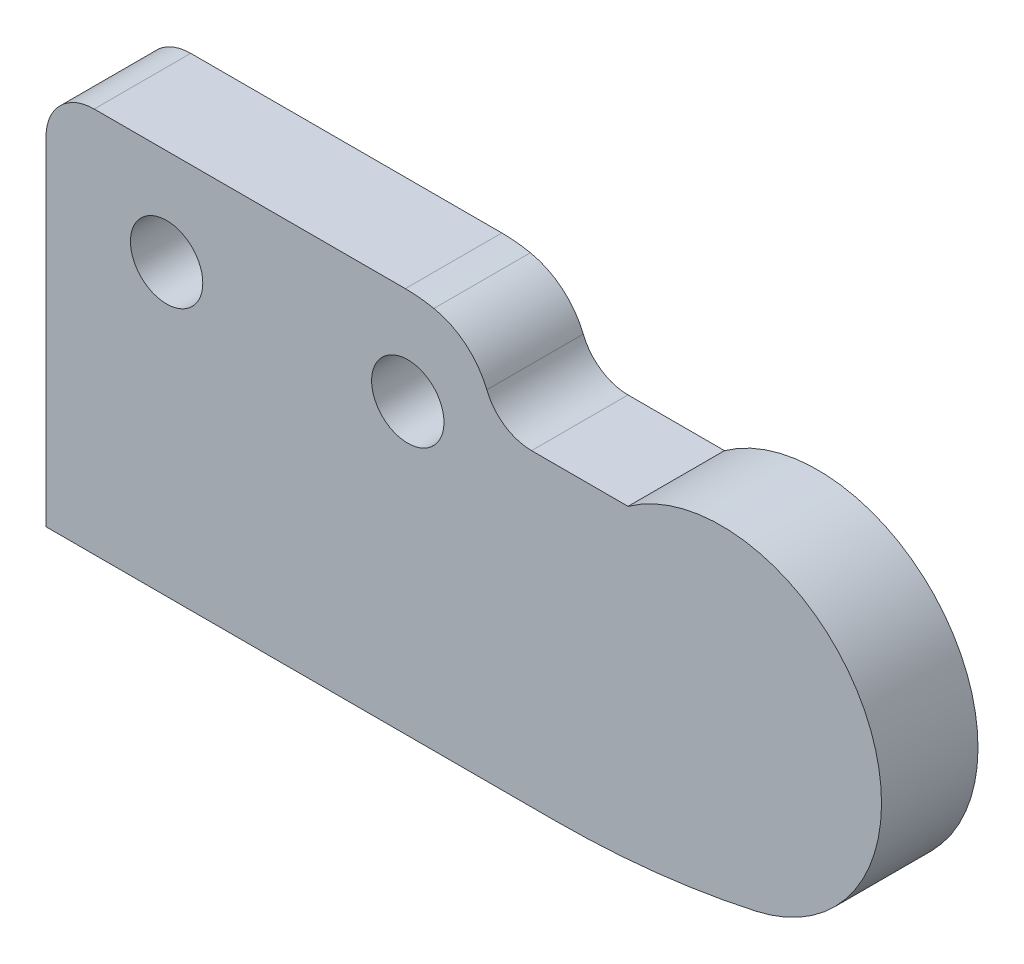
ISO-10303-21;
HEADER;
FILE_DESCRIPTION(('STEP AP214'),'2;1');
FILE_NAME('part.step','',(''),(''),'','','');
FILE_SCHEMA(('AUTOMOTIVE_DESIGN { 1 0 10303 214 1 1 1 1 }'));
ENDSEC;
DATA;
#1=APPLICATION_CONTEXT('core data for automotive mechanical design processes');
#2=APPLICATION_PROTOCOL_DEFINITION('international standard','automotive_design',2000,#1);
#3=PRODUCT_CONTEXT('',#1,'mechanical');
#4=PRODUCT('Part','Part','',(#3));
#5=PRODUCT_RELATED_PRODUCT_CATEGORY('part','',(#4));
#6=PRODUCT_DEFINITION_FORMATION('','',#4);
#7=PRODUCT_DEFINITION_CONTEXT('part definition',#1,'design');
#8=PRODUCT_DEFINITION('design','',#6,#7);
#9=PRODUCT_DEFINITION_SHAPE('','',#8);
#10=(LENGTH_UNIT() NAMED_UNIT(*) SI_UNIT(.MILLI.,.METRE.));
#11=(NAMED_UNIT(*) PLANE_ANGLE_UNIT() SI_UNIT($,.RADIAN.));
#12=(NAMED_UNIT(*) SI_UNIT($,.STERADIAN.) SOLID_ANGLE_UNIT());
#13=UNCERTAINTY_MEASURE_WITH_UNIT(LENGTH_MEASURE(1.E-05),#10,'distance_accuracy_value','');
#14=(GEOMETRIC_REPRESENTATION_CONTEXT(3) GLOBAL_UNCERTAINTY_ASSIGNED_CONTEXT((#13)) GLOBAL_UNIT_ASSIGNED_CONTEXT((#10,
#11,#12)) REPRESENTATION_CONTEXT('',''));
#15=CARTESIAN_POINT('',(0.,0.,0.));
#16=DIRECTION('',(0.,0.,1.));
#17=DIRECTION('',(1.,0.,0.));
#18=AXIS2_PLACEMENT_3D('',#15,#16,#17);
#19=CARTESIAN_POINT('',(-1.5,1.,2.));
#20=DIRECTION('',(0.,0.,1.));
#21=DIRECTION('',(1.,0.,0.));
#22=AXIS2_PLACEMENT_3D('',#19,#20,#21);
#23=PLANE('',#22);
#24=CARTESIAN_POINT('',(0.,0.,2.));
#25=DIRECTION('',(0.,0.,1.));
#26=DIRECTION('',(1.,0.,0.));
#27=AXIS2_PLACEMENT_3D('',#24,#25,#26);
#28=CIRCLE('',#27,0.75);
#29=CARTESIAN_POINT('',(0.75,0.,2.));
#30=VERTEX_POINT('',#29);
#31=EDGE_CURVE('E147',#30,#30,#28,.T.);
#32=ORIENTED_EDGE('',*,*,#31,.F.);
#33=EDGE_LOOP('',(#32));
#34=FACE_BOUND('',#33,.T.);
#35=CARTESIAN_POINT('',(-1.5,1.,2.));
#36=DIRECTION('',(0.,0.,1.));
#37=DIRECTION('',(1.,0.,0.));
#38=AXIS2_PLACEMENT_3D('',#35,#36,#37);
#39=CIRCLE('',#38,1.);
#40=CARTESIAN_POINT('',(-1.5,2.,2.));
#41=VERTEX_POINT('',#40);
#42=CARTESIAN_POINT('',(-2.5,0.999999999999999,2.));
#43=VERTEX_POINT('',#42);
#44=EDGE_CURVE('E162',#41,#43,#39,.T.);
#45=ORIENTED_EDGE('',*,*,#44,.T.);
#46=DIRECTION('',(0.,-1.,0.));
#47=VECTOR('',#46,1.);
#48=CARTESIAN_POINT('',(-2.5,0.999999999999999,2.));
#49=LINE('',#48,#47);
#50=CARTESIAN_POINT('',(-2.5,-6.,2.));
#51=VERTEX_POINT('',#50);
#52=EDGE_CURVE('E100',#43,#51,#49,.T.);
#53=ORIENTED_EDGE('',*,*,#52,.T.);
#54=DIRECTION('',(1.,0.,0.));
#55=VECTOR('',#54,1.);
#56=CARTESIAN_POINT('',(-2.5,-6.,2.));
#57=LINE('',#56,#55);
#58=CARTESIAN_POINT('',(8.03164583027408,-6.,2.));
#59=VERTEX_POINT('',#58);
#60=EDGE_CURVE('E183',#51,#59,#57,.T.);
#61=ORIENTED_EDGE('',*,*,#60,.T.);
#62=CARTESIAN_POINT('',(8.03164583027408,13.3857690870871,2.));
#63=DIRECTION('',(0.,0.,1.));
#64=DIRECTION('',(-1.,0.,0.));
#65=AXIS2_PLACEMENT_3D('',#62,#63,#64);
#66=CIRCLE('',#65,19.3857690870871);
#67=CARTESIAN_POINT('',(12.2170300254932,-5.5427966862691,2.));
#68=VERTEX_POINT('',#67);
#69=EDGE_CURVE('E202',#59,#68,#66,.T.);
#70=ORIENTED_EDGE('',*,*,#69,.T.);
#71=CARTESIAN_POINT('',(11.5,-2.3,2.));
#72=DIRECTION('',(0.,0.,1.));
#73=DIRECTION('',(-1.,0.,0.));
#74=AXIS2_PLACEMENT_3D('',#71,#72,#73);
#75=CIRCLE('',#74,3.3211236661613);
#76=CARTESIAN_POINT('',(9.56612761384402,0.400000000000001,2.));
#77=VERTEX_POINT('',#76);
#78=EDGE_CURVE('E199',#68,#77,#75,.T.);
#79=ORIENTED_EDGE('',*,*,#78,.T.);
#80=DIRECTION('',(-1.,0.,0.));
#81=VECTOR('',#80,1.);
#82=CARTESIAN_POINT('',(9.56612761384402,0.4,2.));
#83=LINE('',#82,#81);
#84=CARTESIAN_POINT('',(7.56612761384402,0.4,2.));
#85=VERTEX_POINT('',#84);
#86=EDGE_CURVE('E201',#77,#85,#83,.T.);
#87=ORIENTED_EDGE('',*,*,#86,.T.);
#88=CARTESIAN_POINT('',(7.56612761384402,1.4,2.));
#89=DIRECTION('',(0.,0.,-1.));
#90=DIRECTION('',(1.,0.,0.));
#91=AXIS2_PLACEMENT_3D('',#88,#89,#90);
#92=CIRCLE('',#91,1.);
#93=CARTESIAN_POINT('',(6.63783296713904,1.02815453626691,2.));
#94=VERTEX_POINT('',#93);
#95=EDGE_CURVE('E125',#85,#94,#92,.T.);
#96=ORIENTED_EDGE('',*,*,#95,.T.);
#97=CARTESIAN_POINT('',(5.24539099708157,0.470386340667267,2.));
#98=DIRECTION('',(0.,0.,1.));
#99=DIRECTION('',(-1.,0.,0.));
#100=AXIS2_PLACEMENT_3D('',#97,#98,#99);
#101=CIRCLE('',#100,1.5);
#102=CARTESIAN_POINT('',(5.54197826784538,1.94077268133453,2.));
#103=VERTEX_POINT('',#102);
#104=EDGE_CURVE('E119',#94,#103,#101,.T.);
#105=ORIENTED_EDGE('',*,*,#104,.T.);
#106=CARTESIAN_POINT('',(4.94880372631776,-1.,2.));
#107=DIRECTION('',(0.,0.,1.));
#108=DIRECTION('',(-1.,0.,0.));
#109=AXIS2_PLACEMENT_3D('',#106,#107,#108);
#110=CIRCLE('',#109,3.);
#111=CARTESIAN_POINT('',(4.94880372631776,2.,2.));
#112=VERTEX_POINT('',#111);
#113=EDGE_CURVE('E123',#103,#112,#110,.T.);
#114=ORIENTED_EDGE('',*,*,#113,.T.);
#115=DIRECTION('',(-1.,0.,0.));
#116=VECTOR('',#115,1.);
#117=CARTESIAN_POINT('',(4.94880372631776,2.,2.));
#118=LINE('',#117,#116);
#119=EDGE_CURVE('E51',#112,#41,#118,.T.);
#120=ORIENTED_EDGE('',*,*,#119,.T.);
#121=EDGE_LOOP('',(#45,#53,#61,#70,#79,#87,#96,#105,#114,#120));
#122=FACE_BOUND('',#121,.T.);
#123=CARTESIAN_POINT('',(5.,0.,2.));
#124=DIRECTION('',(0.,0.,1.));
#125=DIRECTION('',(1.,0.,0.));
#126=AXIS2_PLACEMENT_3D('',#123,#124,#125);
#127=CIRCLE('',#126,0.750000000000001);
#128=CARTESIAN_POINT('',(5.75,0.,2.));
#129=VERTEX_POINT('',#128);
#130=EDGE_CURVE('E213',#129,#129,#127,.T.);
#131=ORIENTED_EDGE('',*,*,#130,.F.);
#132=EDGE_LOOP('',(#131));
#133=FACE_BOUND('',#132,.T.);
#134=ADVANCED_FACE('F34',(#34,#122,#133),#23,.T.);
#135=CARTESIAN_POINT('',(-1.5,1.,0.));
#136=DIRECTION('',(0.,0.,1.));
#137=DIRECTION('',(1.,0.,0.));
#138=AXIS2_PLACEMENT_3D('',#135,#136,#137);
#139=PLANE('',#138);
#140=CARTESIAN_POINT('',(-1.5,1.,0.));
#141=DIRECTION('',(0.,0.,1.));
#142=DIRECTION('',(1.,0.,0.));
#143=AXIS2_PLACEMENT_3D('',#140,#141,#142);
#144=CIRCLE('',#143,1.);
#145=CARTESIAN_POINT('',(-1.5,2.,0.));
#146=VERTEX_POINT('',#145);
#147=CARTESIAN_POINT('',(-2.5,0.999999999999999,0.));
#148=VERTEX_POINT('',#147);
#149=EDGE_CURVE('E143',#146,#148,#144,.T.);
#150=ORIENTED_EDGE('',*,*,#149,.F.);
#151=DIRECTION('',(-1.,0.,0.));
#152=VECTOR('',#151,1.);
#153=CARTESIAN_POINT('',(4.94880372631776,2.,0.));
#154=LINE('',#153,#152);
#155=CARTESIAN_POINT('',(4.94880372631776,2.,0.));
#156=VERTEX_POINT('',#155);
#157=EDGE_CURVE('E92',#156,#146,#154,.T.);
#158=ORIENTED_EDGE('',*,*,#157,.F.);
#159=CARTESIAN_POINT('',(4.94880372631776,-1.,0.));
#160=DIRECTION('',(0.,0.,1.));
#161=DIRECTION('',(-1.,0.,0.));
#162=AXIS2_PLACEMENT_3D('',#159,#160,#161);
#163=CIRCLE('',#162,3.);
#164=CARTESIAN_POINT('',(5.54197826784538,1.94077268133453,0.));
#165=VERTEX_POINT('',#164);
#166=EDGE_CURVE('E86',#165,#156,#163,.T.);
#167=ORIENTED_EDGE('',*,*,#166,.F.);
#168=CARTESIAN_POINT('',(5.24539099708157,0.470386340667267,0.));
#169=DIRECTION('',(0.,0.,1.));
#170=DIRECTION('',(-1.,0.,0.));
#171=AXIS2_PLACEMENT_3D('',#168,#169,#170);
#172=CIRCLE('',#171,1.5);
#173=CARTESIAN_POINT('',(6.63783296713904,1.02815453626691,0.));
#174=VERTEX_POINT('',#173);
#175=EDGE_CURVE('E133',#174,#165,#172,.T.);
#176=ORIENTED_EDGE('',*,*,#175,.F.);
#177=CARTESIAN_POINT('',(7.56612761384402,1.4,0.));
#178=DIRECTION('',(0.,0.,-1.));
#179=DIRECTION('',(1.,0.,0.));
#180=AXIS2_PLACEMENT_3D('',#177,#178,#179);
#181=CIRCLE('',#180,1.);
#182=CARTESIAN_POINT('',(7.56612761384402,0.4,0.));
#183=VERTEX_POINT('',#182);
#184=EDGE_CURVE('E157',#183,#174,#181,.T.);
#185=ORIENTED_EDGE('',*,*,#184,.F.);
#186=DIRECTION('',(-1.,0.,0.));
#187=VECTOR('',#186,1.);
#188=CARTESIAN_POINT('',(9.56612761384402,0.4,0.));
#189=LINE('',#188,#187);
#190=CARTESIAN_POINT('',(9.56612761384402,0.400000000000001,0.));
#191=VERTEX_POINT('',#190);
#192=EDGE_CURVE('E155',#191,#183,#189,.T.);
#193=ORIENTED_EDGE('',*,*,#192,.F.);
#194=CARTESIAN_POINT('',(11.5,-2.3,0.));
#195=DIRECTION('',(0.,0.,1.));
#196=DIRECTION('',(-1.,0.,0.));
#197=AXIS2_PLACEMENT_3D('',#194,#195,#196);
#198=CIRCLE('',#197,3.3211236661613);
#199=CARTESIAN_POINT('',(12.2170300254932,-5.5427966862691,0.));
#200=VERTEX_POINT('',#199);
#201=EDGE_CURVE('E153',#200,#191,#198,.T.);
#202=ORIENTED_EDGE('',*,*,#201,.F.);
#203=CARTESIAN_POINT('',(8.03164583027408,13.3857690870871,0.));
#204=DIRECTION('',(0.,0.,1.));
#205=DIRECTION('',(-1.,0.,0.));
#206=AXIS2_PLACEMENT_3D('',#203,#204,#205);
#207=CIRCLE('',#206,19.3857690870871);
#208=CARTESIAN_POINT('',(8.03164583027408,-6.,0.));
#209=VERTEX_POINT('',#208);
#210=EDGE_CURVE('E151',#209,#200,#207,.T.);
#211=ORIENTED_EDGE('',*,*,#210,.F.);
#212=DIRECTION('',(1.,0.,0.));
#213=VECTOR('',#212,1.);
#214=CARTESIAN_POINT('',(-2.5,-6.,0.));
#215=LINE('',#214,#213);
#216=CARTESIAN_POINT('',(-2.5,-6.,0.));
#217=VERTEX_POINT('',#216);
#218=EDGE_CURVE('E149',#217,#209,#215,.T.);
#219=ORIENTED_EDGE('',*,*,#218,.F.);
#220=DIRECTION('',(0.,-1.,0.));
#221=VECTOR('',#220,1.);
#222=CARTESIAN_POINT('',(-2.5,0.999999999999999,0.));
#223=LINE('',#222,#221);
#224=EDGE_CURVE('E146',#148,#217,#223,.T.);
#225=ORIENTED_EDGE('',*,*,#224,.F.);
#226=EDGE_LOOP('',(#150,#158,#167,#176,#185,#193,#202,#211,#219,#225));
#227=FACE_BOUND('',#226,.T.);
#228=CARTESIAN_POINT('',(0.,0.,0.));
#229=DIRECTION('',(0.,0.,1.));
#230=DIRECTION('',(1.,0.,0.));
#231=AXIS2_PLACEMENT_3D('',#228,#229,#230);
#232=CIRCLE('',#231,0.75);
#233=CARTESIAN_POINT('',(0.75,0.,0.));
#234=VERTEX_POINT('',#233);
#235=EDGE_CURVE('E210',#234,#234,#232,.T.);
#236=ORIENTED_EDGE('',*,*,#235,.T.);
#237=EDGE_LOOP('',(#236));
#238=FACE_BOUND('',#237,.T.);
#239=CARTESIAN_POINT('',(5.,0.,0.));
#240=DIRECTION('',(0.,0.,1.));
#241=DIRECTION('',(1.,0.,0.));
#242=AXIS2_PLACEMENT_3D('',#239,#240,#241);
#243=CIRCLE('',#242,0.750000000000001);
#244=CARTESIAN_POINT('',(5.75,0.,0.));
#245=VERTEX_POINT('',#244);
#246=EDGE_CURVE('E216',#245,#245,#243,.T.);
#247=ORIENTED_EDGE('',*,*,#246,.T.);
#248=EDGE_LOOP('',(#247));
#249=FACE_BOUND('',#248,.T.);
#250=ADVANCED_FACE('F187',(#227,#238,#249),#139,.F.);
#251=CARTESIAN_POINT('',(-1.5,1.,2.));
#252=DIRECTION('',(0.,0.,-1.));
#253=DIRECTION('',(-1.,0.,0.));
#254=AXIS2_PLACEMENT_3D('',#251,#252,#253);
#255=CYLINDRICAL_SURFACE('',#254,1.);
#256=ORIENTED_EDGE('',*,*,#149,.T.);
#257=DIRECTION('',(0.,0.,-1.));
#258=VECTOR('',#257,1.);
#259=CARTESIAN_POINT('',(-2.5,0.999999999999999,2.));
#260=LINE('',#259,#258);
#261=EDGE_CURVE('E11',#43,#148,#260,.T.);
#262=ORIENTED_EDGE('',*,*,#261,.F.);
#263=ORIENTED_EDGE('',*,*,#44,.F.);
#264=DIRECTION('',(0.,0.,-1.));
#265=VECTOR('',#264,1.);
#266=CARTESIAN_POINT('',(-1.5,2.,2.));
#267=LINE('',#266,#265);
#268=EDGE_CURVE('E139',#41,#146,#267,.T.);
#269=ORIENTED_EDGE('',*,*,#268,.T.);
#270=EDGE_LOOP('',(#256,#262,#263,#269));
#271=FACE_BOUND('',#270,.T.);
#272=ADVANCED_FACE('F36',(#271),#255,.T.);
#273=CARTESIAN_POINT('',(-2.5,0.999999999999999,2.));
#274=DIRECTION('',(1.,0.,0.));
#275=DIRECTION('',(0.,1.,0.));
#276=AXIS2_PLACEMENT_3D('',#273,#274,#275);
#277=PLANE('',#276);
#278=ORIENTED_EDGE('',*,*,#224,.T.);
#279=DIRECTION('',(0.,0.,-1.));
#280=VECTOR('',#279,1.);
#281=CARTESIAN_POINT('',(-2.5,-6.,2.));
#282=LINE('',#281,#280);
#283=EDGE_CURVE('E43',#51,#217,#282,.T.);
#284=ORIENTED_EDGE('',*,*,#283,.F.);
#285=ORIENTED_EDGE('',*,*,#52,.F.);
#286=ORIENTED_EDGE('',*,*,#261,.T.);
#287=EDGE_LOOP('',(#278,#284,#285,#286));
#288=FACE_BOUND('',#287,.T.);
#289=ADVANCED_FACE('F256',(#288),#277,.F.);
#290=CARTESIAN_POINT('',(-2.5,-6.,2.));
#291=DIRECTION('',(0.,1.,0.));
#292=DIRECTION('',(-1.,0.,0.));
#293=AXIS2_PLACEMENT_3D('',#290,#291,#292);
#294=PLANE('',#293);
#295=ORIENTED_EDGE('',*,*,#218,.T.);
#296=DIRECTION('',(0.,0.,-1.));
#297=VECTOR('',#296,1.);
#298=CARTESIAN_POINT('',(8.03164583027408,-6.,2.));
#299=LINE('',#298,#297);
#300=EDGE_CURVE('E175',#59,#209,#299,.T.);
#301=ORIENTED_EDGE('',*,*,#300,.F.);
#302=ORIENTED_EDGE('',*,*,#60,.F.);
#303=ORIENTED_EDGE('',*,*,#283,.T.);
#304=EDGE_LOOP('',(#295,#301,#302,#303));
#305=FACE_BOUND('',#304,.T.);
#306=ADVANCED_FACE('F181',(#305),#294,.F.);
#307=CARTESIAN_POINT('',(8.03164583027408,13.3857690870871,2.));
#308=DIRECTION('',(0.,0.,-1.));
#309=DIRECTION('',(-1.,0.,0.));
#310=AXIS2_PLACEMENT_3D('',#307,#308,#309);
#311=CYLINDRICAL_SURFACE('',#310,19.3857690870871);
#312=ORIENTED_EDGE('',*,*,#210,.T.);
#313=DIRECTION('',(0.,0.,-1.));
#314=VECTOR('',#313,1.);
#315=CARTESIAN_POINT('',(12.2170300254932,-5.5427966862691,2.));
#316=LINE('',#315,#314);
#317=EDGE_CURVE('E172',#68,#200,#316,.T.);
#318=ORIENTED_EDGE('',*,*,#317,.F.);
#319=ORIENTED_EDGE('',*,*,#69,.F.);
#320=ORIENTED_EDGE('',*,*,#300,.T.);
#321=EDGE_LOOP('',(#312,#318,#319,#320));
#322=FACE_BOUND('',#321,.T.);
#323=ADVANCED_FACE('F193',(#322),#311,.T.);
#324=CARTESIAN_POINT('',(11.5,-2.3,2.));
#325=DIRECTION('',(0.,0.,-1.));
#326=DIRECTION('',(-1.,0.,0.));
#327=AXIS2_PLACEMENT_3D('',#324,#325,#326);
#328=CYLINDRICAL_SURFACE('',#327,3.3211236661613);
#329=ORIENTED_EDGE('',*,*,#201,.T.);
#330=DIRECTION('',(0.,0.,-1.));
#331=VECTOR('',#330,1.);
#332=CARTESIAN_POINT('',(9.56612761384402,0.400000000000001,2.));
#333=LINE('',#332,#331);
#334=EDGE_CURVE('E169',#77,#191,#333,.T.);
#335=ORIENTED_EDGE('',*,*,#334,.F.);
#336=ORIENTED_EDGE('',*,*,#78,.F.);
#337=ORIENTED_EDGE('',*,*,#317,.T.);
#338=EDGE_LOOP('',(#329,#335,#336,#337));
#339=FACE_BOUND('',#338,.T.);
#340=ADVANCED_FACE('F197',(#339),#328,.T.);
#341=CARTESIAN_POINT('',(9.56612761384402,0.4,2.));
#342=DIRECTION('',(0.,-1.,0.));
#343=DIRECTION('',(1.,0.,0.));
#344=AXIS2_PLACEMENT_3D('',#341,#342,#343);
#345=PLANE('',#344);
#346=ORIENTED_EDGE('',*,*,#192,.T.);
#347=DIRECTION('',(0.,0.,-1.));
#348=VECTOR('',#347,1.);
#349=CARTESIAN_POINT('',(7.56612761384402,0.4,2.));
#350=LINE('',#349,#348);
#351=EDGE_CURVE('E166',#85,#183,#350,.T.);
#352=ORIENTED_EDGE('',*,*,#351,.F.);
#353=ORIENTED_EDGE('',*,*,#86,.F.);
#354=ORIENTED_EDGE('',*,*,#334,.T.);
#355=EDGE_LOOP('',(#346,#352,#353,#354));
#356=FACE_BOUND('',#355,.T.);
#357=ADVANCED_FACE('F246',(#356),#345,.F.);
#358=CARTESIAN_POINT('',(7.56612761384402,1.4,2.));
#359=DIRECTION('',(0.,0.,-1.));
#360=DIRECTION('',(-1.,0.,0.));
#361=AXIS2_PLACEMENT_3D('',#358,#359,#360);
#362=CYLINDRICAL_SURFACE('',#361,1.);
#363=ORIENTED_EDGE('',*,*,#184,.T.);
#364=DIRECTION('',(0.,0.,-1.));
#365=VECTOR('',#364,1.);
#366=CARTESIAN_POINT('',(6.63783296713904,1.02815453626691,2.));
#367=LINE('',#366,#365);
#368=EDGE_CURVE('E134',#94,#174,#367,.T.);
#369=ORIENTED_EDGE('',*,*,#368,.F.);
#370=ORIENTED_EDGE('',*,*,#95,.F.);
#371=ORIENTED_EDGE('',*,*,#351,.T.);
#372=EDGE_LOOP('',(#363,#369,#370,#371));
#373=FACE_BOUND('',#372,.T.);
#374=ADVANCED_FACE('F243',(#373),#362,.F.);
#375=CARTESIAN_POINT('',(5.24539099708157,0.470386340667267,2.));
#376=DIRECTION('',(0.,0.,-1.));
#377=DIRECTION('',(-1.,0.,0.));
#378=AXIS2_PLACEMENT_3D('',#375,#376,#377);
#379=CYLINDRICAL_SURFACE('',#378,1.5);
#380=ORIENTED_EDGE('',*,*,#175,.T.);
#381=DIRECTION('',(0.,0.,-1.));
#382=VECTOR('',#381,1.);
#383=CARTESIAN_POINT('',(5.54197826784538,1.94077268133453,2.));
#384=LINE('',#383,#382);
#385=EDGE_CURVE('E130',#103,#165,#384,.T.);
#386=ORIENTED_EDGE('',*,*,#385,.F.);
#387=ORIENTED_EDGE('',*,*,#104,.F.);
#388=ORIENTED_EDGE('',*,*,#368,.T.);
#389=EDGE_LOOP('',(#380,#386,#387,#388));
#390=FACE_BOUND('',#389,.T.);
#391=ADVANCED_FACE('F131',(#390),#379,.T.);
#392=CARTESIAN_POINT('',(4.94880372631776,-1.,2.));
#393=DIRECTION('',(0.,0.,-1.));
#394=DIRECTION('',(-1.,0.,0.));
#395=AXIS2_PLACEMENT_3D('',#392,#393,#394);
#396=CYLINDRICAL_SURFACE('',#395,3.);
#397=ORIENTED_EDGE('',*,*,#166,.T.);
#398=DIRECTION('',(0.,0.,-1.));
#399=VECTOR('',#398,1.);
#400=CARTESIAN_POINT('',(4.94880372631776,2.,2.));
#401=LINE('',#400,#399);
#402=EDGE_CURVE('E135',#112,#156,#401,.T.);
#403=ORIENTED_EDGE('',*,*,#402,.F.);
#404=ORIENTED_EDGE('',*,*,#113,.F.);
#405=ORIENTED_EDGE('',*,*,#385,.T.);
#406=EDGE_LOOP('',(#397,#403,#404,#405));
#407=FACE_BOUND('',#406,.T.);
#408=ADVANCED_FACE('F137',(#407),#396,.T.);
#409=CARTESIAN_POINT('',(4.94880372631776,2.,2.));
#410=DIRECTION('',(0.,-1.,0.));
#411=DIRECTION('',(1.,0.,0.));
#412=AXIS2_PLACEMENT_3D('',#409,#410,#411);
#413=PLANE('',#412);
#414=ORIENTED_EDGE('',*,*,#157,.T.);
#415=ORIENTED_EDGE('',*,*,#268,.F.);
#416=ORIENTED_EDGE('',*,*,#119,.F.);
#417=ORIENTED_EDGE('',*,*,#402,.T.);
#418=EDGE_LOOP('',(#414,#415,#416,#417));
#419=FACE_BOUND('',#418,.T.);
#420=ADVANCED_FACE('F236',(#419),#413,.F.);
#421=CARTESIAN_POINT('',(0.,0.,2.));
#422=DIRECTION('',(0.,0.,-1.));
#423=DIRECTION('',(-1.,0.,0.));
#424=AXIS2_PLACEMENT_3D('',#421,#422,#423);
#425=CYLINDRICAL_SURFACE('',#424,0.75);
#426=ORIENTED_EDGE('',*,*,#31,.T.);
#427=EDGE_LOOP('',(#426));
#428=FACE_BOUND('',#427,.T.);
#429=ORIENTED_EDGE('',*,*,#235,.F.);
#430=EDGE_LOOP('',(#429));
#431=FACE_BOUND('',#430,.T.);
#432=ADVANCED_FACE('F233',(#428,#431),#425,.F.);
#433=CARTESIAN_POINT('',(5.,0.,2.));
#434=DIRECTION('',(0.,0.,-1.));
#435=DIRECTION('',(-1.,0.,0.));
#436=AXIS2_PLACEMENT_3D('',#433,#434,#435);
#437=CYLINDRICAL_SURFACE('',#436,0.750000000000001);
#438=ORIENTED_EDGE('',*,*,#130,.T.);
#439=EDGE_LOOP('',(#438));
#440=FACE_BOUND('',#439,.T.);
#441=ORIENTED_EDGE('',*,*,#246,.F.);
#442=EDGE_LOOP('',(#441));
#443=FACE_BOUND('',#442,.T.);
#444=ADVANCED_FACE('F222',(#440,#443),#437,.F.);
#445=CLOSED_SHELL('',(#134,#250,#272,#289,#306,#323,#340,#357,#374,#391,#408,#420,#432,#444));
#446=MANIFOLD_SOLID_BREP('B2',#445);
#447=ADVANCED_BREP_SHAPE_REPRESENTATION('',(#18,#446),#14);
#448=SHAPE_DEFINITION_REPRESENTATION(#9,#447);
ENDSEC;
END-ISO-10303-21;
